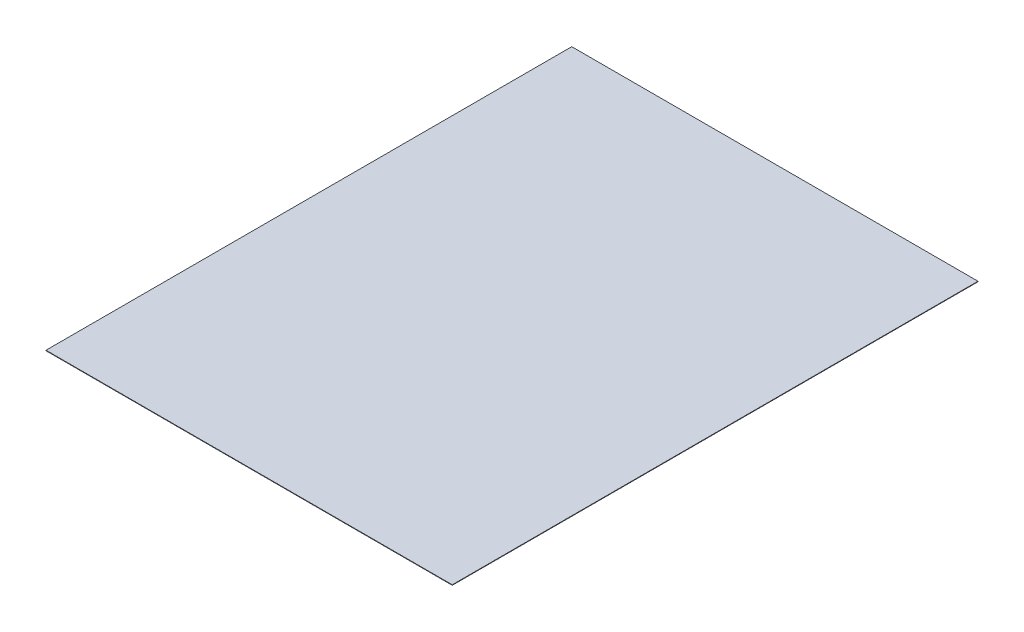
ISO-10303-21;
HEADER;
FILE_DESCRIPTION(('STEP AP214'),'2;1');
FILE_NAME('part.step','',(''),(''),'','','');
FILE_SCHEMA(('AUTOMOTIVE_DESIGN { 1 0 10303 214 1 1 1 1 }'));
ENDSEC;
DATA;
#1=APPLICATION_CONTEXT('core data for automotive mechanical design processes');
#2=APPLICATION_PROTOCOL_DEFINITION('international standard','automotive_design',2000,#1);
#3=PRODUCT_CONTEXT('',#1,'mechanical');
#4=PRODUCT('Part','Part','',(#3));
#5=PRODUCT_RELATED_PRODUCT_CATEGORY('part','',(#4));
#6=PRODUCT_DEFINITION_FORMATION('','',#4);
#7=PRODUCT_DEFINITION_CONTEXT('part definition',#1,'design');
#8=PRODUCT_DEFINITION('design','',#6,#7);
#9=PRODUCT_DEFINITION_SHAPE('','',#8);
#10=(LENGTH_UNIT() NAMED_UNIT(*) SI_UNIT(.MILLI.,.METRE.));
#11=(NAMED_UNIT(*) PLANE_ANGLE_UNIT() SI_UNIT($,.RADIAN.));
#12=(NAMED_UNIT(*) SI_UNIT($,.STERADIAN.) SOLID_ANGLE_UNIT());
#13=UNCERTAINTY_MEASURE_WITH_UNIT(LENGTH_MEASURE(1.E-05),#10,'distance_accuracy_value','');
#14=(GEOMETRIC_REPRESENTATION_CONTEXT(3) GLOBAL_UNCERTAINTY_ASSIGNED_CONTEXT((#13)) GLOBAL_UNIT_ASSIGNED_CONTEXT((#10,
#11,#12)) REPRESENTATION_CONTEXT('',''));
#15=CARTESIAN_POINT('',(0.,0.,0.));
#16=DIRECTION('',(0.,0.,1.));
#17=DIRECTION('',(1.,0.,0.));
#18=AXIS2_PLACEMENT_3D('',#15,#16,#17);
#19=CARTESIAN_POINT('',(0.,0.254,0.));
#20=DIRECTION('',(1.,0.,0.));
#21=DIRECTION('',(0.,0.,-1.));
#22=AXIS2_PLACEMENT_3D('',#19,#20,#21);
#23=PLANE('',#22);
#24=DIRECTION('',(0.,0.,1.));
#25=VECTOR('',#24,1.);
#26=CARTESIAN_POINT('',(0.,0.,0.));
#27=LINE('',#26,#25);
#28=CARTESIAN_POINT('',(0.,0.,-279.4));
#29=VERTEX_POINT('',#28);
#30=CARTESIAN_POINT('',(0.,0.,0.));
#31=VERTEX_POINT('',#30);
#32=EDGE_CURVE('E95',#29,#31,#27,.T.);
#33=ORIENTED_EDGE('',*,*,#32,.T.);
#34=DIRECTION('',(0.,-1.,0.));
#35=VECTOR('',#34,1.);
#36=CARTESIAN_POINT('',(0.,0.254,0.));
#37=LINE('',#36,#35);
#38=CARTESIAN_POINT('',(0.,0.254,0.));
#39=VERTEX_POINT('',#38);
#40=EDGE_CURVE('E11',#39,#31,#37,.T.);
#41=ORIENTED_EDGE('',*,*,#40,.F.);
#42=DIRECTION('',(0.,0.,1.));
#43=VECTOR('',#42,1.);
#44=CARTESIAN_POINT('',(0.,0.254,0.));
#45=LINE('',#44,#43);
#46=CARTESIAN_POINT('',(0.,0.254,-279.4));
#47=VERTEX_POINT('',#46);
#48=EDGE_CURVE('E83',#47,#39,#45,.T.);
#49=ORIENTED_EDGE('',*,*,#48,.F.);
#50=DIRECTION('',(0.,-1.,0.));
#51=VECTOR('',#50,1.);
#52=CARTESIAN_POINT('',(0.,0.254,-279.4));
#53=LINE('',#52,#51);
#54=EDGE_CURVE('E91',#47,#29,#53,.T.);
#55=ORIENTED_EDGE('',*,*,#54,.T.);
#56=EDGE_LOOP('',(#33,#41,#49,#55));
#57=FACE_BOUND('',#56,.T.);
#58=ADVANCED_FACE('F32',(#57),#23,.F.);
#59=CARTESIAN_POINT('',(0.,0.254,0.));
#60=DIRECTION('',(0.,0.,-1.));
#61=DIRECTION('',(-1.,0.,0.));
#62=AXIS2_PLACEMENT_3D('',#59,#60,#61);
#63=PLANE('',#62);
#64=DIRECTION('',(1.,0.,0.));
#65=VECTOR('',#64,1.);
#66=CARTESIAN_POINT('',(0.,0.,0.));
#67=LINE('',#66,#65);
#68=CARTESIAN_POINT('',(215.9,0.,0.));
#69=VERTEX_POINT('',#68);
#70=EDGE_CURVE('E87',#31,#69,#67,.T.);
#71=ORIENTED_EDGE('',*,*,#70,.T.);
#72=DIRECTION('',(0.,-1.,0.));
#73=VECTOR('',#72,1.);
#74=CARTESIAN_POINT('',(215.9,0.254,0.));
#75=LINE('',#74,#73);
#76=CARTESIAN_POINT('',(215.9,0.254,0.));
#77=VERTEX_POINT('',#76);
#78=EDGE_CURVE('E40',#77,#69,#75,.T.);
#79=ORIENTED_EDGE('',*,*,#78,.F.);
#80=DIRECTION('',(1.,0.,0.));
#81=VECTOR('',#80,1.);
#82=CARTESIAN_POINT('',(0.,0.254,0.));
#83=LINE('',#82,#81);
#84=EDGE_CURVE('E78',#39,#77,#83,.T.);
#85=ORIENTED_EDGE('',*,*,#84,.F.);
#86=ORIENTED_EDGE('',*,*,#40,.T.);
#87=EDGE_LOOP('',(#71,#79,#85,#86));
#88=FACE_BOUND('',#87,.T.);
#89=ADVANCED_FACE('F86',(#88),#63,.F.);
#90=CARTESIAN_POINT('',(215.9,0.254,0.));
#91=DIRECTION('',(-1.,0.,0.));
#92=DIRECTION('',(0.,0.,1.));
#93=AXIS2_PLACEMENT_3D('',#90,#91,#92);
#94=PLANE('',#93);
#95=DIRECTION('',(0.,0.,-1.));
#96=VECTOR('',#95,1.);
#97=CARTESIAN_POINT('',(215.9,0.,0.));
#98=LINE('',#97,#96);
#99=CARTESIAN_POINT('',(215.9,0.,-279.4));
#100=VERTEX_POINT('',#99);
#101=EDGE_CURVE('E65',#69,#100,#98,.T.);
#102=ORIENTED_EDGE('',*,*,#101,.T.);
#103=DIRECTION('',(0.,-1.,0.));
#104=VECTOR('',#103,1.);
#105=CARTESIAN_POINT('',(215.9,0.254,-279.4));
#106=LINE('',#105,#104);
#107=CARTESIAN_POINT('',(215.9,0.254,-279.4));
#108=VERTEX_POINT('',#107);
#109=EDGE_CURVE('E88',#108,#100,#106,.T.);
#110=ORIENTED_EDGE('',*,*,#109,.F.);
#111=DIRECTION('',(0.,0.,-1.));
#112=VECTOR('',#111,1.);
#113=CARTESIAN_POINT('',(215.9,0.254,0.));
#114=LINE('',#113,#112);
#115=EDGE_CURVE('E81',#77,#108,#114,.T.);
#116=ORIENTED_EDGE('',*,*,#115,.F.);
#117=ORIENTED_EDGE('',*,*,#78,.T.);
#118=EDGE_LOOP('',(#102,#110,#116,#117));
#119=FACE_BOUND('',#118,.T.);
#120=ADVANCED_FACE('F89',(#119),#94,.F.);
#121=CARTESIAN_POINT('',(0.,0.254,-279.4));
#122=DIRECTION('',(0.,0.,1.));
#123=DIRECTION('',(1.,0.,0.));
#124=AXIS2_PLACEMENT_3D('',#121,#122,#123);
#125=PLANE('',#124);
#126=DIRECTION('',(-1.,0.,0.));
#127=VECTOR('',#126,1.);
#128=CARTESIAN_POINT('',(0.,0.,-279.4));
#129=LINE('',#128,#127);
#130=EDGE_CURVE('E71',#100,#29,#129,.T.);
#131=ORIENTED_EDGE('',*,*,#130,.T.);
#132=ORIENTED_EDGE('',*,*,#54,.F.);
#133=DIRECTION('',(-1.,0.,0.));
#134=VECTOR('',#133,1.);
#135=CARTESIAN_POINT('',(0.,0.254,-279.4));
#136=LINE('',#135,#134);
#137=EDGE_CURVE('E48',#108,#47,#136,.T.);
#138=ORIENTED_EDGE('',*,*,#137,.F.);
#139=ORIENTED_EDGE('',*,*,#109,.T.);
#140=EDGE_LOOP('',(#131,#132,#138,#139));
#141=FACE_BOUND('',#140,.T.);
#142=ADVANCED_FACE('F102',(#141),#125,.F.);
#143=CARTESIAN_POINT('',(0.,0.254,0.));
#144=DIRECTION('',(0.,-1.,0.));
#145=DIRECTION('',(0.,0.,-1.));
#146=AXIS2_PLACEMENT_3D('',#143,#144,#145);
#147=PLANE('',#146);
#148=ORIENTED_EDGE('',*,*,#48,.T.);
#149=ORIENTED_EDGE('',*,*,#84,.T.);
#150=ORIENTED_EDGE('',*,*,#115,.T.);
#151=ORIENTED_EDGE('',*,*,#137,.T.);
#152=EDGE_LOOP('',(#148,#149,#150,#151));
#153=FACE_BOUND('',#152,.T.);
#154=ADVANCED_FACE('F79',(#153),#147,.F.);
#155=CARTESIAN_POINT('',(0.,0.,0.));
#156=DIRECTION('',(0.,-1.,0.));
#157=DIRECTION('',(0.,0.,-1.));
#158=AXIS2_PLACEMENT_3D('',#155,#156,#157);
#159=PLANE('',#158);
#160=ORIENTED_EDGE('',*,*,#32,.F.);
#161=ORIENTED_EDGE('',*,*,#130,.F.);
#162=ORIENTED_EDGE('',*,*,#101,.F.);
#163=ORIENTED_EDGE('',*,*,#70,.F.);
#164=EDGE_LOOP('',(#160,#161,#162,#163));
#165=FACE_BOUND('',#164,.T.);
#166=ADVANCED_FACE('F105',(#165),#159,.T.);
#167=CLOSED_SHELL('',(#58,#89,#120,#142,#154,#166));
#168=MANIFOLD_SOLID_BREP('B2',#167);
#169=ADVANCED_BREP_SHAPE_REPRESENTATION('',(#18,#168),#14);
#170=SHAPE_DEFINITION_REPRESENTATION(#9,#169);
ENDSEC;
END-ISO-10303-21;
